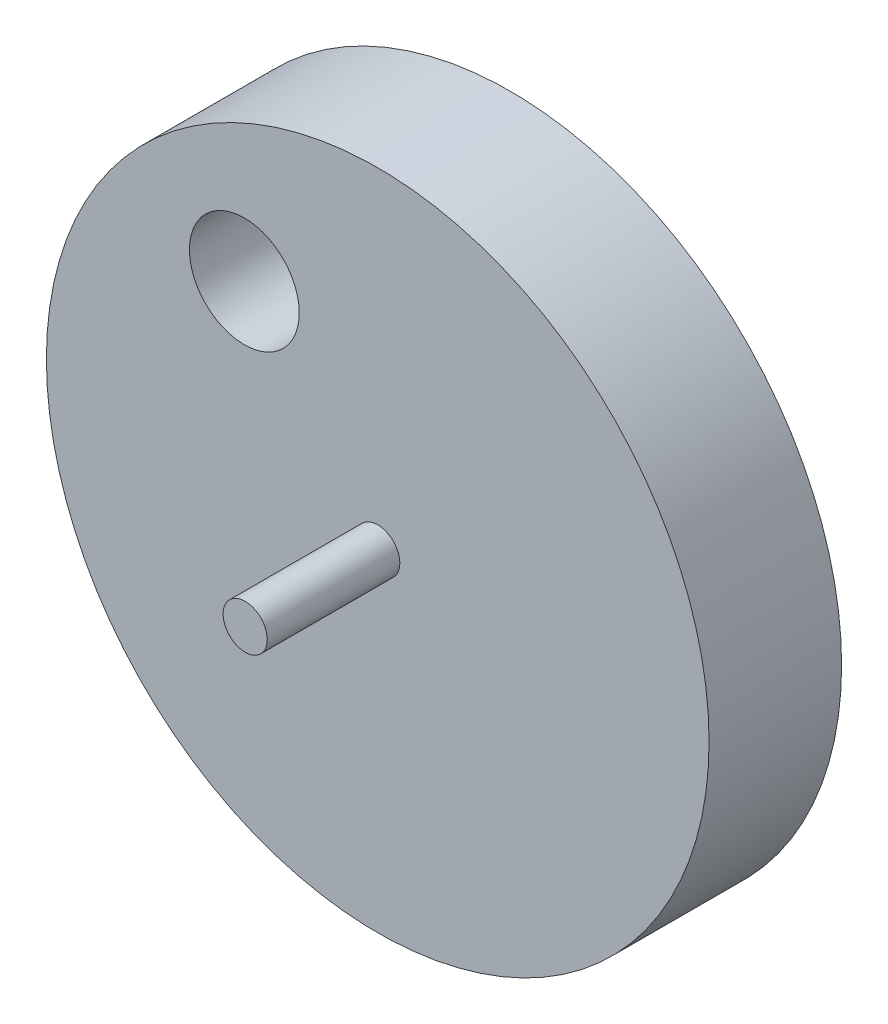
ISO-10303-21;
HEADER;
FILE_DESCRIPTION(('STEP AP214'),'2;1');
FILE_NAME('part.step','',(''),(''),'','','');
FILE_SCHEMA(('AUTOMOTIVE_DESIGN { 1 0 10303 214 1 1 1 1 }'));
ENDSEC;
DATA;
#1=APPLICATION_CONTEXT('core data for automotive mechanical design processes');
#2=APPLICATION_PROTOCOL_DEFINITION('international standard','automotive_design',2000,#1);
#3=PRODUCT_CONTEXT('',#1,'mechanical');
#4=PRODUCT('Part','Part','',(#3));
#5=PRODUCT_RELATED_PRODUCT_CATEGORY('part','',(#4));
#6=PRODUCT_DEFINITION_FORMATION('','',#4);
#7=PRODUCT_DEFINITION_CONTEXT('part definition',#1,'design');
#8=PRODUCT_DEFINITION('design','',#6,#7);
#9=PRODUCT_DEFINITION_SHAPE('','',#8);
#10=(LENGTH_UNIT() NAMED_UNIT(*) SI_UNIT(.MILLI.,.METRE.));
#11=(NAMED_UNIT(*) PLANE_ANGLE_UNIT() SI_UNIT($,.RADIAN.));
#12=(NAMED_UNIT(*) SI_UNIT($,.STERADIAN.) SOLID_ANGLE_UNIT());
#13=UNCERTAINTY_MEASURE_WITH_UNIT(LENGTH_MEASURE(1.E-05),#10,'distance_accuracy_value','');
#14=(GEOMETRIC_REPRESENTATION_CONTEXT(3) GLOBAL_UNCERTAINTY_ASSIGNED_CONTEXT((#13)) GLOBAL_UNIT_ASSIGNED_CONTEXT((#10,
#11,#12)) REPRESENTATION_CONTEXT('',''));
#15=CARTESIAN_POINT('',(0.,0.,0.));
#16=DIRECTION('',(0.,0.,1.));
#17=DIRECTION('',(1.,0.,0.));
#18=AXIS2_PLACEMENT_3D('',#15,#16,#17);
#19=CARTESIAN_POINT('',(0.,0.,30.));
#20=DIRECTION('',(0.,0.,1.));
#21=DIRECTION('',(1.,0.,0.));
#22=AXIS2_PLACEMENT_3D('',#19,#20,#21);
#23=PLANE('',#22);
#24=CARTESIAN_POINT('',(0.,0.,30.));
#25=DIRECTION('',(0.,0.,1.));
#26=DIRECTION('',(1.,0.,0.));
#27=AXIS2_PLACEMENT_3D('',#24,#25,#26);
#28=CIRCLE('',#27,5.);
#29=CARTESIAN_POINT('',(5.,0.,30.));
#30=VERTEX_POINT('',#29);
#31=EDGE_CURVE('E44',#30,#30,#28,.T.);
#32=ORIENTED_EDGE('',*,*,#31,.F.);
#33=EDGE_LOOP('',(#32));
#34=FACE_BOUND('',#33,.T.);
#35=CARTESIAN_POINT('',(0.,0.,30.));
#36=DIRECTION('',(0.,0.,1.));
#37=DIRECTION('',(1.,0.,0.));
#38=AXIS2_PLACEMENT_3D('',#35,#36,#37);
#39=CIRCLE('',#38,75.);
#40=CARTESIAN_POINT('',(75.,0.,30.));
#41=VERTEX_POINT('',#40);
#42=EDGE_CURVE('E10',#41,#41,#39,.T.);
#43=ORIENTED_EDGE('',*,*,#42,.T.);
#44=EDGE_LOOP('',(#43));
#45=FACE_BOUND('',#44,.T.);
#46=CARTESIAN_POINT('',(-30.1950350090156,37.6254755025948,30.));
#47=DIRECTION('',(0.,0.,1.));
#48=DIRECTION('',(1.,0.,0.));
#49=AXIS2_PLACEMENT_3D('',#46,#47,#48);
#50=CIRCLE('',#49,12.4274883987138);
#51=CARTESIAN_POINT('',(-17.7675466103018,37.6254755025948,30.));
#52=VERTEX_POINT('',#51);
#53=EDGE_CURVE('E48',#52,#52,#50,.T.);
#54=ORIENTED_EDGE('',*,*,#53,.F.);
#55=EDGE_LOOP('',(#54));
#56=FACE_BOUND('',#55,.T.);
#57=ADVANCED_FACE('F33',(#34,#45,#56),#23,.T.);
#58=CARTESIAN_POINT('',(0.,0.,0.));
#59=DIRECTION('',(0.,0.,1.));
#60=DIRECTION('',(1.,0.,0.));
#61=AXIS2_PLACEMENT_3D('',#58,#59,#60);
#62=PLANE('',#61);
#63=CARTESIAN_POINT('',(0.,0.,0.));
#64=DIRECTION('',(0.,0.,1.));
#65=DIRECTION('',(1.,0.,0.));
#66=AXIS2_PLACEMENT_3D('',#63,#64,#65);
#67=CIRCLE('',#66,75.);
#68=CARTESIAN_POINT('',(75.,0.,0.));
#69=VERTEX_POINT('',#68);
#70=EDGE_CURVE('E37',#69,#69,#67,.T.);
#71=ORIENTED_EDGE('',*,*,#70,.F.);
#72=EDGE_LOOP('',(#71));
#73=FACE_BOUND('',#72,.T.);
#74=CARTESIAN_POINT('',(0.,0.,0.));
#75=DIRECTION('',(0.,0.,1.));
#76=DIRECTION('',(1.,0.,0.));
#77=AXIS2_PLACEMENT_3D('',#74,#75,#76);
#78=CIRCLE('',#77,5.);
#79=CARTESIAN_POINT('',(5.,0.,0.));
#80=VERTEX_POINT('',#79);
#81=EDGE_CURVE('E52',#80,#80,#78,.T.);
#82=ORIENTED_EDGE('',*,*,#81,.T.);
#83=EDGE_LOOP('',(#82));
#84=FACE_BOUND('',#83,.T.);
#85=CARTESIAN_POINT('',(-30.1950350090156,37.6254755025948,0.));
#86=DIRECTION('',(0.,0.,1.));
#87=DIRECTION('',(1.,0.,0.));
#88=AXIS2_PLACEMENT_3D('',#85,#86,#87);
#89=CIRCLE('',#88,12.4274883987138);
#90=CARTESIAN_POINT('',(-17.7675466103018,37.6254755025948,0.));
#91=VERTEX_POINT('',#90);
#92=EDGE_CURVE('E49',#91,#91,#89,.T.);
#93=ORIENTED_EDGE('',*,*,#92,.T.);
#94=EDGE_LOOP('',(#93));
#95=FACE_BOUND('',#94,.T.);
#96=ADVANCED_FACE('F81',(#73,#84,#95),#62,.F.);
#97=CARTESIAN_POINT('',(0.,0.,30.));
#98=DIRECTION('',(0.,0.,-1.));
#99=DIRECTION('',(-1.,0.,0.));
#100=AXIS2_PLACEMENT_3D('',#97,#98,#99);
#101=CYLINDRICAL_SURFACE('',#100,75.);
#102=ORIENTED_EDGE('',*,*,#42,.F.);
#103=EDGE_LOOP('',(#102));
#104=FACE_BOUND('',#103,.T.);
#105=ORIENTED_EDGE('',*,*,#70,.T.);
#106=EDGE_LOOP('',(#105));
#107=FACE_BOUND('',#106,.T.);
#108=ADVANCED_FACE('F35',(#104,#107),#101,.T.);
#109=CARTESIAN_POINT('',(-30.1950350090156,37.6254755025948,30.));
#110=DIRECTION('',(0.,0.,-1.));
#111=DIRECTION('',(-1.,0.,0.));
#112=AXIS2_PLACEMENT_3D('',#109,#110,#111);
#113=CYLINDRICAL_SURFACE('',#112,12.4274883987138);
#114=ORIENTED_EDGE('',*,*,#53,.T.);
#115=EDGE_LOOP('',(#114));
#116=FACE_BOUND('',#115,.T.);
#117=ORIENTED_EDGE('',*,*,#92,.F.);
#118=EDGE_LOOP('',(#117));
#119=FACE_BOUND('',#118,.T.);
#120=ADVANCED_FACE('F89',(#116,#119),#113,.F.);
#121=CARTESIAN_POINT('',(0.,0.,-30.));
#122=DIRECTION('',(0.,0.,1.));
#123=DIRECTION('',(1.,0.,0.));
#124=AXIS2_PLACEMENT_3D('',#121,#122,#123);
#125=PLANE('',#124);
#126=CARTESIAN_POINT('',(0.,0.,-30.));
#127=DIRECTION('',(0.,0.,1.));
#128=DIRECTION('',(1.,0.,0.));
#129=AXIS2_PLACEMENT_3D('',#126,#127,#128);
#130=CIRCLE('',#129,5.);
#131=CARTESIAN_POINT('',(5.,0.,-30.));
#132=VERTEX_POINT('',#131);
#133=EDGE_CURVE('E57',#132,#132,#130,.T.);
#134=ORIENTED_EDGE('',*,*,#133,.F.);
#135=EDGE_LOOP('',(#134));
#136=FACE_BOUND('',#135,.T.);
#137=ADVANCED_FACE('F76',(#136),#125,.F.);
#138=CARTESIAN_POINT('',(0.,0.,-30.));
#139=DIRECTION('',(0.,0.,1.));
#140=DIRECTION('',(1.,0.,0.));
#141=AXIS2_PLACEMENT_3D('',#138,#139,#140);
#142=CYLINDRICAL_SURFACE('',#141,5.);
#143=ORIENTED_EDGE('',*,*,#133,.T.);
#144=EDGE_LOOP('',(#143));
#145=FACE_BOUND('',#144,.T.);
#146=ORIENTED_EDGE('',*,*,#81,.F.);
#147=EDGE_LOOP('',(#146));
#148=FACE_BOUND('',#147,.T.);
#149=ADVANCED_FACE('F68',(#145,#148),#142,.T.);
#150=ORIENTED_EDGE('',*,*,#31,.T.);
#151=EDGE_LOOP('',(#150));
#152=FACE_BOUND('',#151,.T.);
#153=CARTESIAN_POINT('',(0.,0.,60.));
#154=DIRECTION('',(0.,0.,1.));
#155=DIRECTION('',(1.,0.,0.));
#156=AXIS2_PLACEMENT_3D('',#153,#154,#155);
#157=CIRCLE('',#156,5.);
#158=CARTESIAN_POINT('',(5.,0.,60.));
#159=VERTEX_POINT('',#158);
#160=EDGE_CURVE('E60',#159,#159,#157,.T.);
#161=ORIENTED_EDGE('',*,*,#160,.F.);
#162=EDGE_LOOP('',(#161));
#163=FACE_BOUND('',#162,.T.);
#164=ADVANCED_FACE('F66',(#152,#163),#142,.T.);
#165=CARTESIAN_POINT('',(0.,0.,60.));
#166=DIRECTION('',(0.,0.,1.));
#167=DIRECTION('',(1.,0.,0.));
#168=AXIS2_PLACEMENT_3D('',#165,#166,#167);
#169=PLANE('',#168);
#170=ORIENTED_EDGE('',*,*,#160,.T.);
#171=EDGE_LOOP('',(#170));
#172=FACE_BOUND('',#171,.T.);
#173=ADVANCED_FACE('F64',(#172),#169,.T.);
#174=CLOSED_SHELL('',(#57,#96,#108,#120,#137,#149,#164,#173));
#175=MANIFOLD_SOLID_BREP('B2',#174);
#176=ADVANCED_BREP_SHAPE_REPRESENTATION('',(#18,#175),#14);
#177=SHAPE_DEFINITION_REPRESENTATION(#9,#176);
ENDSEC;
END-ISO-10303-21;
